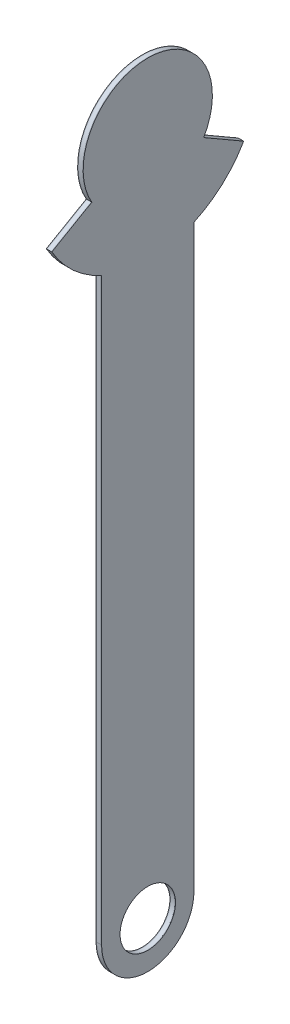
ISO-10303-21;
HEADER;
FILE_DESCRIPTION(('STEP AP214'),'2;1');
FILE_NAME('part.step','',(''),(''),'','','');
FILE_SCHEMA(('AUTOMOTIVE_DESIGN { 1 0 10303 214 1 1 1 1 }'));
ENDSEC;
DATA;
#1=APPLICATION_CONTEXT('core data for automotive mechanical design processes');
#2=APPLICATION_PROTOCOL_DEFINITION('international standard','automotive_design',2000,#1);
#3=PRODUCT_CONTEXT('',#1,'mechanical');
#4=PRODUCT('Part','Part','',(#3));
#5=PRODUCT_RELATED_PRODUCT_CATEGORY('part','',(#4));
#6=PRODUCT_DEFINITION_FORMATION('','',#4);
#7=PRODUCT_DEFINITION_CONTEXT('part definition',#1,'design');
#8=PRODUCT_DEFINITION('design','',#6,#7);
#9=PRODUCT_DEFINITION_SHAPE('','',#8);
#10=(LENGTH_UNIT() NAMED_UNIT(*) SI_UNIT(.MILLI.,.METRE.));
#11=(NAMED_UNIT(*) PLANE_ANGLE_UNIT() SI_UNIT($,.RADIAN.));
#12=(NAMED_UNIT(*) SI_UNIT($,.STERADIAN.) SOLID_ANGLE_UNIT());
#13=UNCERTAINTY_MEASURE_WITH_UNIT(LENGTH_MEASURE(1.E-05),#10,'distance_accuracy_value','');
#14=(GEOMETRIC_REPRESENTATION_CONTEXT(3) GLOBAL_UNCERTAINTY_ASSIGNED_CONTEXT((#13)) GLOBAL_UNIT_ASSIGNED_CONTEXT((#10,
#11,#12)) REPRESENTATION_CONTEXT('',''));
#15=CARTESIAN_POINT('',(0.,0.,0.));
#16=DIRECTION('',(0.,0.,1.));
#17=DIRECTION('',(1.,0.,0.));
#18=AXIS2_PLACEMENT_3D('',#15,#16,#17);
#19=CARTESIAN_POINT('',(-2.75,196.8,0.));
#20=DIRECTION('',(1.,0.,0.));
#21=DIRECTION('',(0.,0.,-1.));
#22=AXIS2_PLACEMENT_3D('',#19,#20,#21);
#23=CYLINDRICAL_SURFACE('',#22,60.);
#24=CARTESIAN_POINT('',(-2.5,196.8,0.));
#25=DIRECTION('',(-1.,0.,0.));
#26=DIRECTION('',(0.,0.,1.));
#27=AXIS2_PLACEMENT_3D('',#24,#25,#26);
#28=CIRCLE('',#27,60.);
#29=CARTESIAN_POINT('',(-2.5,142.256439426821,25.));
#30=VERTEX_POINT('',#29);
#31=CARTESIAN_POINT('',(-2.5,166.8,51.9615242270665));
#32=VERTEX_POINT('',#31);
#33=EDGE_CURVE('E162',#30,#32,#28,.T.);
#34=ORIENTED_EDGE('',*,*,#33,.T.);
#35=DIRECTION('',(1.,0.,0.));
#36=VECTOR('',#35,1.);
#37=CARTESIAN_POINT('',(-2.75,166.8,51.9615242270665));
#38=LINE('',#37,#36);
#39=CARTESIAN_POINT('',(-2.75,166.8,51.9615242270665));
#40=VERTEX_POINT('',#39);
#41=EDGE_CURVE('E12',#40,#32,#38,.T.);
#42=ORIENTED_EDGE('',*,*,#41,.F.);
#43=CARTESIAN_POINT('',(-2.75,196.8,0.));
#44=DIRECTION('',(-1.,0.,0.));
#45=DIRECTION('',(0.,0.,1.));
#46=AXIS2_PLACEMENT_3D('',#43,#44,#45);
#47=CIRCLE('',#46,60.);
#48=CARTESIAN_POINT('',(-2.75,142.256439426821,25.));
#49=VERTEX_POINT('',#48);
#50=EDGE_CURVE('E208',#49,#40,#47,.T.);
#51=ORIENTED_EDGE('',*,*,#50,.F.);
#52=DIRECTION('',(1.,0.,0.));
#53=VECTOR('',#52,1.);
#54=CARTESIAN_POINT('',(-2.75,142.256439426821,25.));
#55=LINE('',#54,#53);
#56=EDGE_CURVE('E155',#49,#30,#55,.T.);
#57=ORIENTED_EDGE('',*,*,#56,.T.);
#58=EDGE_LOOP('',(#34,#42,#51,#57));
#59=FACE_BOUND('',#58,.T.);
#60=ADVANCED_FACE('F62',(#59),#23,.T.);
#61=CARTESIAN_POINT('',(-2.75,147.600000000001,85.2168997323883));
#62=DIRECTION('',(0.,-0.866025403784441,-0.499999999999995));
#63=DIRECTION('',(0.,0.499999999999995,-0.866025403784442));
#64=AXIS2_PLACEMENT_3D('',#61,#62,#63);
#65=PLANE('',#64);
#66=DIRECTION('',(0.,0.499999999999995,-0.866025403784442));
#67=VECTOR('',#66,1.);
#68=CARTESIAN_POINT('',(-2.5,147.600000000001,85.2168997323883));
#69=LINE('',#68,#67);
#70=CARTESIAN_POINT('',(-2.5,179.3,30.3108891324555));
#71=VERTEX_POINT('',#70);
#72=EDGE_CURVE('E165',#32,#71,#69,.T.);
#73=ORIENTED_EDGE('',*,*,#72,.T.);
#74=DIRECTION('',(1.,0.,0.));
#75=VECTOR('',#74,1.);
#76=CARTESIAN_POINT('',(-2.75,179.3,30.3108891324555));
#77=LINE('',#76,#75);
#78=CARTESIAN_POINT('',(-2.75,179.3,30.3108891324555));
#79=VERTEX_POINT('',#78);
#80=EDGE_CURVE('E71',#79,#71,#77,.T.);
#81=ORIENTED_EDGE('',*,*,#80,.F.);
#82=DIRECTION('',(0.,0.499999999999995,-0.866025403784442));
#83=VECTOR('',#82,1.);
#84=CARTESIAN_POINT('',(-2.75,147.600000000001,85.2168997323883));
#85=LINE('',#84,#83);
#86=EDGE_CURVE('E122',#40,#79,#85,.T.);
#87=ORIENTED_EDGE('',*,*,#86,.F.);
#88=ORIENTED_EDGE('',*,*,#41,.T.);
#89=EDGE_LOOP('',(#73,#81,#87,#88));
#90=FACE_BOUND('',#89,.T.);
#91=ADVANCED_FACE('F227',(#90),#65,.F.);
#92=CARTESIAN_POINT('',(-2.75,196.8,0.));
#93=DIRECTION('',(1.,0.,0.));
#94=DIRECTION('',(0.,0.,-1.));
#95=AXIS2_PLACEMENT_3D('',#92,#93,#94);
#96=CYLINDRICAL_SURFACE('',#95,35.);
#97=CARTESIAN_POINT('',(-2.5,196.8,0.));
#98=DIRECTION('',(-1.,0.,0.));
#99=DIRECTION('',(0.,0.,1.));
#100=AXIS2_PLACEMENT_3D('',#97,#98,#99);
#101=CIRCLE('',#100,35.);
#102=CARTESIAN_POINT('',(-2.5,179.3,-30.3108891324553));
#103=VERTEX_POINT('',#102);
#104=EDGE_CURVE('E167',#71,#103,#101,.T.);
#105=ORIENTED_EDGE('',*,*,#104,.T.);
#106=DIRECTION('',(1.,0.,0.));
#107=VECTOR('',#106,1.);
#108=CARTESIAN_POINT('',(-2.75,179.3,-30.3108891324553));
#109=LINE('',#108,#107);
#110=CARTESIAN_POINT('',(-2.75,179.3,-30.3108891324553));
#111=VERTEX_POINT('',#110);
#112=EDGE_CURVE('E183',#111,#103,#109,.T.);
#113=ORIENTED_EDGE('',*,*,#112,.F.);
#114=CARTESIAN_POINT('',(-2.75,196.8,0.));
#115=DIRECTION('',(-1.,0.,0.));
#116=DIRECTION('',(0.,0.,1.));
#117=AXIS2_PLACEMENT_3D('',#114,#115,#116);
#118=CIRCLE('',#117,35.);
#119=EDGE_CURVE('E191',#79,#111,#118,.T.);
#120=ORIENTED_EDGE('',*,*,#119,.F.);
#121=ORIENTED_EDGE('',*,*,#80,.T.);
#122=EDGE_LOOP('',(#105,#113,#120,#121));
#123=FACE_BOUND('',#122,.T.);
#124=ADVANCED_FACE('F189',(#123),#96,.T.);
#125=CARTESIAN_POINT('',(-2.75,147.6,-85.2168997323889));
#126=DIRECTION('',(0.,-0.866025403784438,0.500000000000001));
#127=DIRECTION('',(0.,-0.500000000000001,-0.866025403784438));
#128=AXIS2_PLACEMENT_3D('',#125,#126,#127);
#129=PLANE('',#128);
#130=DIRECTION('',(0.,-0.500000000000001,-0.866025403784438));
#131=VECTOR('',#130,1.);
#132=CARTESIAN_POINT('',(-2.5,147.6,-85.2168997323889));
#133=LINE('',#132,#131);
#134=CARTESIAN_POINT('',(-2.5,166.8,-51.9615242270663));
#135=VERTEX_POINT('',#134);
#136=EDGE_CURVE('E169',#103,#135,#133,.T.);
#137=ORIENTED_EDGE('',*,*,#136,.T.);
#138=DIRECTION('',(1.,0.,0.));
#139=VECTOR('',#138,1.);
#140=CARTESIAN_POINT('',(-2.75,166.8,-51.9615242270663));
#141=LINE('',#140,#139);
#142=CARTESIAN_POINT('',(-2.75,166.8,-51.9615242270663));
#143=VERTEX_POINT('',#142);
#144=EDGE_CURVE('E180',#143,#135,#141,.T.);
#145=ORIENTED_EDGE('',*,*,#144,.F.);
#146=DIRECTION('',(0.,-0.500000000000001,-0.866025403784438));
#147=VECTOR('',#146,1.);
#148=CARTESIAN_POINT('',(-2.75,147.6,-85.2168997323889));
#149=LINE('',#148,#147);
#150=EDGE_CURVE('E203',#111,#143,#149,.T.);
#151=ORIENTED_EDGE('',*,*,#150,.F.);
#152=ORIENTED_EDGE('',*,*,#112,.T.);
#153=EDGE_LOOP('',(#137,#145,#151,#152));
#154=FACE_BOUND('',#153,.T.);
#155=ADVANCED_FACE('F199',(#154),#129,.F.);
#156=CARTESIAN_POINT('',(-2.75,196.8,0.));
#157=DIRECTION('',(1.,0.,0.));
#158=DIRECTION('',(0.,0.,-1.));
#159=AXIS2_PLACEMENT_3D('',#156,#157,#158);
#160=CYLINDRICAL_SURFACE('',#159,60.);
#161=CARTESIAN_POINT('',(-2.5,196.8,0.));
#162=DIRECTION('',(-1.,0.,0.));
#163=DIRECTION('',(0.,0.,1.));
#164=AXIS2_PLACEMENT_3D('',#161,#162,#163);
#165=CIRCLE('',#164,60.);
#166=CARTESIAN_POINT('',(-2.5,142.256439426821,-25.));
#167=VERTEX_POINT('',#166);
#168=EDGE_CURVE('E171',#135,#167,#165,.T.);
#169=ORIENTED_EDGE('',*,*,#168,.T.);
#170=DIRECTION('',(1.,0.,0.));
#171=VECTOR('',#170,1.);
#172=CARTESIAN_POINT('',(-2.75,142.256439426821,-25.));
#173=LINE('',#172,#171);
#174=CARTESIAN_POINT('',(-2.75,142.256439426821,-25.));
#175=VERTEX_POINT('',#174);
#176=EDGE_CURVE('E150',#175,#167,#173,.T.);
#177=ORIENTED_EDGE('',*,*,#176,.F.);
#178=CARTESIAN_POINT('',(-2.75,196.8,0.));
#179=DIRECTION('',(-1.,0.,0.));
#180=DIRECTION('',(0.,0.,1.));
#181=AXIS2_PLACEMENT_3D('',#178,#179,#180);
#182=CIRCLE('',#181,60.);
#183=EDGE_CURVE('E141',#143,#175,#182,.T.);
#184=ORIENTED_EDGE('',*,*,#183,.F.);
#185=ORIENTED_EDGE('',*,*,#144,.T.);
#186=EDGE_LOOP('',(#169,#177,#184,#185));
#187=FACE_BOUND('',#186,.T.);
#188=ADVANCED_FACE('F202',(#187),#160,.T.);
#189=CARTESIAN_POINT('',(-2.75,0.,-25.));
#190=DIRECTION('',(0.,0.,1.));
#191=DIRECTION('',(1.,0.,0.));
#192=AXIS2_PLACEMENT_3D('',#189,#190,#191);
#193=PLANE('',#192);
#194=DIRECTION('',(0.,-1.,0.));
#195=VECTOR('',#194,1.);
#196=CARTESIAN_POINT('',(-2.5,0.,-25.));
#197=LINE('',#196,#195);
#198=CARTESIAN_POINT('',(-2.5,-171.8,-25.));
#199=VERTEX_POINT('',#198);
#200=EDGE_CURVE('E149',#167,#199,#197,.T.);
#201=ORIENTED_EDGE('',*,*,#200,.T.);
#202=DIRECTION('',(1.,0.,0.));
#203=VECTOR('',#202,1.);
#204=CARTESIAN_POINT('',(-2.75,-171.8,-25.));
#205=LINE('',#204,#203);
#206=CARTESIAN_POINT('',(-2.75,-171.8,-25.));
#207=VERTEX_POINT('',#206);
#208=EDGE_CURVE('E146',#207,#199,#205,.T.);
#209=ORIENTED_EDGE('',*,*,#208,.F.);
#210=DIRECTION('',(0.,-1.,0.));
#211=VECTOR('',#210,1.);
#212=CARTESIAN_POINT('',(-2.75,0.,-25.));
#213=LINE('',#212,#211);
#214=EDGE_CURVE('E135',#175,#207,#213,.T.);
#215=ORIENTED_EDGE('',*,*,#214,.F.);
#216=ORIENTED_EDGE('',*,*,#176,.T.);
#217=EDGE_LOOP('',(#201,#209,#215,#216));
#218=FACE_BOUND('',#217,.T.);
#219=ADVANCED_FACE('F147',(#218),#193,.F.);
#220=CARTESIAN_POINT('',(-2.75,-171.8,0.));
#221=DIRECTION('',(1.,0.,0.));
#222=DIRECTION('',(0.,0.,-1.));
#223=AXIS2_PLACEMENT_3D('',#220,#221,#222);
#224=CYLINDRICAL_SURFACE('',#223,25.);
#225=CARTESIAN_POINT('',(-2.5,-171.8,0.));
#226=DIRECTION('',(-1.,0.,0.));
#227=DIRECTION('',(0.,0.,1.));
#228=AXIS2_PLACEMENT_3D('',#225,#226,#227);
#229=CIRCLE('',#228,25.);
#230=CARTESIAN_POINT('',(-2.5,-171.8,25.));
#231=VERTEX_POINT('',#230);
#232=EDGE_CURVE('E108',#199,#231,#229,.T.);
#233=ORIENTED_EDGE('',*,*,#232,.T.);
#234=DIRECTION('',(1.,0.,0.));
#235=VECTOR('',#234,1.);
#236=CARTESIAN_POINT('',(-2.75,-171.8,25.));
#237=LINE('',#236,#235);
#238=CARTESIAN_POINT('',(-2.75,-171.8,25.));
#239=VERTEX_POINT('',#238);
#240=EDGE_CURVE('E151',#239,#231,#237,.T.);
#241=ORIENTED_EDGE('',*,*,#240,.F.);
#242=CARTESIAN_POINT('',(-2.75,-171.8,0.));
#243=DIRECTION('',(-1.,0.,0.));
#244=DIRECTION('',(0.,0.,1.));
#245=AXIS2_PLACEMENT_3D('',#242,#243,#244);
#246=CIRCLE('',#245,25.);
#247=EDGE_CURVE('E139',#207,#239,#246,.T.);
#248=ORIENTED_EDGE('',*,*,#247,.F.);
#249=ORIENTED_EDGE('',*,*,#208,.T.);
#250=EDGE_LOOP('',(#233,#241,#248,#249));
#251=FACE_BOUND('',#250,.T.);
#252=ADVANCED_FACE('F153',(#251),#224,.T.);
#253=CARTESIAN_POINT('',(-2.75,-171.8,0.));
#254=DIRECTION('',(1.,0.,0.));
#255=DIRECTION('',(0.,0.,-1.));
#256=AXIS2_PLACEMENT_3D('',#253,#254,#255);
#257=CYLINDRICAL_SURFACE('',#256,15.);
#258=CARTESIAN_POINT('',(-2.75,-171.8,0.));
#259=DIRECTION('',(-1.,0.,0.));
#260=DIRECTION('',(0.,0.,1.));
#261=AXIS2_PLACEMENT_3D('',#258,#259,#260);
#262=CIRCLE('',#261,15.);
#263=CARTESIAN_POINT('',(-2.75,-171.8,15.));
#264=VERTEX_POINT('',#263);
#265=EDGE_CURVE('E176',#264,#264,#262,.F.);
#266=ORIENTED_EDGE('',*,*,#265,.F.);
#267=EDGE_LOOP('',(#266));
#268=FACE_BOUND('',#267,.T.);
#269=CARTESIAN_POINT('',(-2.5,-171.8,0.));
#270=DIRECTION('',(-1.,0.,0.));
#271=DIRECTION('',(0.,0.,1.));
#272=AXIS2_PLACEMENT_3D('',#269,#270,#271);
#273=CIRCLE('',#272,15.);
#274=CARTESIAN_POINT('',(-2.5,-171.8,15.));
#275=VERTEX_POINT('',#274);
#276=EDGE_CURVE('E159',#275,#275,#273,.F.);
#277=ORIENTED_EDGE('',*,*,#276,.T.);
#278=EDGE_LOOP('',(#277));
#279=FACE_BOUND('',#278,.T.);
#280=ADVANCED_FACE('F64',(#268,#279),#257,.F.);
#281=CARTESIAN_POINT('',(-2.75,0.,25.));
#282=DIRECTION('',(0.,0.,-1.));
#283=DIRECTION('',(-1.,0.,0.));
#284=AXIS2_PLACEMENT_3D('',#281,#282,#283);
#285=PLANE('',#284);
#286=DIRECTION('',(0.,1.,0.));
#287=VECTOR('',#286,1.);
#288=CARTESIAN_POINT('',(-2.5,0.,25.));
#289=LINE('',#288,#287);
#290=EDGE_CURVE('E114',#231,#30,#289,.T.);
#291=ORIENTED_EDGE('',*,*,#290,.T.);
#292=ORIENTED_EDGE('',*,*,#56,.F.);
#293=DIRECTION('',(0.,1.,0.));
#294=VECTOR('',#293,1.);
#295=CARTESIAN_POINT('',(-2.75,0.,25.));
#296=LINE('',#295,#294);
#297=EDGE_CURVE('E79',#239,#49,#296,.T.);
#298=ORIENTED_EDGE('',*,*,#297,.F.);
#299=ORIENTED_EDGE('',*,*,#240,.T.);
#300=EDGE_LOOP('',(#291,#292,#298,#299));
#301=FACE_BOUND('',#300,.T.);
#302=ADVANCED_FACE('F216',(#301),#285,.F.);
#303=CARTESIAN_POINT('',(-2.75,0.,0.));
#304=DIRECTION('',(-1.,0.,0.));
#305=DIRECTION('',(0.,0.,1.));
#306=AXIS2_PLACEMENT_3D('',#303,#304,#305);
#307=PLANE('',#306);
#308=ORIENTED_EDGE('',*,*,#265,.T.);
#309=EDGE_LOOP('',(#308));
#310=FACE_BOUND('',#309,.T.);
#311=ORIENTED_EDGE('',*,*,#50,.T.);
#312=ORIENTED_EDGE('',*,*,#86,.T.);
#313=ORIENTED_EDGE('',*,*,#119,.T.);
#314=ORIENTED_EDGE('',*,*,#150,.T.);
#315=ORIENTED_EDGE('',*,*,#183,.T.);
#316=ORIENTED_EDGE('',*,*,#214,.T.);
#317=ORIENTED_EDGE('',*,*,#247,.T.);
#318=ORIENTED_EDGE('',*,*,#297,.T.);
#319=EDGE_LOOP('',(#311,#312,#313,#314,#315,#316,#317,#318));
#320=FACE_BOUND('',#319,.T.);
#321=ADVANCED_FACE('F137',(#310,#320),#307,.T.);
#322=CARTESIAN_POINT('',(-2.5,0.,0.));
#323=DIRECTION('',(-1.,0.,0.));
#324=DIRECTION('',(0.,0.,1.));
#325=AXIS2_PLACEMENT_3D('',#322,#323,#324);
#326=PLANE('',#325);
#327=ORIENTED_EDGE('',*,*,#276,.F.);
#328=EDGE_LOOP('',(#327));
#329=FACE_BOUND('',#328,.T.);
#330=ORIENTED_EDGE('',*,*,#33,.F.);
#331=ORIENTED_EDGE('',*,*,#290,.F.);
#332=ORIENTED_EDGE('',*,*,#232,.F.);
#333=ORIENTED_EDGE('',*,*,#200,.F.);
#334=ORIENTED_EDGE('',*,*,#168,.F.);
#335=ORIENTED_EDGE('',*,*,#136,.F.);
#336=ORIENTED_EDGE('',*,*,#104,.F.);
#337=ORIENTED_EDGE('',*,*,#72,.F.);
#338=EDGE_LOOP('',(#330,#331,#332,#333,#334,#335,#336,#337));
#339=FACE_BOUND('',#338,.T.);
#340=ADVANCED_FACE('F195',(#329,#339),#326,.F.);
#341=CLOSED_SHELL('',(#60,#91,#124,#155,#188,#219,#252,#280,#302,#321,#340));
#342=MANIFOLD_SOLID_BREP('B2',#341);
#343=CARTESIAN_POINT('',(-2.5,147.600000000001,85.2168997323882));
#344=DIRECTION('',(0.,-0.866025403784442,-0.499999999999995));
#345=DIRECTION('',(0.,0.499999999999995,-0.866025403784442));
#346=AXIS2_PLACEMENT_3D('',#343,#344,#345);
#347=PLANE('',#346);
#348=DIRECTION('',(0.,0.499999999999995,-0.866025403784442));
#349=VECTOR('',#348,1.);
#350=CARTESIAN_POINT('',(0.,147.600000000001,85.2168997323882));
#351=LINE('',#350,#349);
#352=CARTESIAN_POINT('',(0.,166.8,51.9615242270665));
#353=VERTEX_POINT('',#352);
#354=CARTESIAN_POINT('',(0.,179.3,30.3108891324555));
#355=VERTEX_POINT('',#354);
#356=EDGE_CURVE('E429',#353,#355,#351,.T.);
#357=ORIENTED_EDGE('',*,*,#356,.T.);
#358=DIRECTION('',(1.,0.,0.));
#359=VECTOR('',#358,1.);
#360=CARTESIAN_POINT('',(-2.5,179.3,30.3108891324555));
#361=LINE('',#360,#359);
#362=CARTESIAN_POINT('',(-2.5,179.3,30.3108891324555));
#363=VERTEX_POINT('',#362);
#364=EDGE_CURVE('E60',#363,#355,#361,.T.);
#365=ORIENTED_EDGE('',*,*,#364,.F.);
#366=DIRECTION('',(0.,0.499999999999995,-0.866025403784442));
#367=VECTOR('',#366,1.);
#368=CARTESIAN_POINT('',(-2.5,147.600000000001,85.2168997323882));
#369=LINE('',#368,#367);
#370=CARTESIAN_POINT('',(-2.5,166.8,51.9615242270665));
#371=VERTEX_POINT('',#370);
#372=EDGE_CURVE('E455',#371,#363,#369,.T.);
#373=ORIENTED_EDGE('',*,*,#372,.F.);
#374=DIRECTION('',(1.,0.,0.));
#375=VECTOR('',#374,1.);
#376=CARTESIAN_POINT('',(-2.5,166.8,51.9615242270665));
#377=LINE('',#376,#375);
#378=EDGE_CURVE('E428',#371,#353,#377,.T.);
#379=ORIENTED_EDGE('',*,*,#378,.T.);
#380=EDGE_LOOP('',(#357,#365,#373,#379));
#381=FACE_BOUND('',#380,.T.);
#382=ADVANCED_FACE('F323',(#381),#347,.F.);
#383=CARTESIAN_POINT('',(-2.5,196.8,0.));
#384=DIRECTION('',(1.,0.,0.));
#385=DIRECTION('',(0.,0.,-1.));
#386=AXIS2_PLACEMENT_3D('',#383,#384,#385);
#387=CYLINDRICAL_SURFACE('',#386,35.);
#388=CARTESIAN_POINT('',(0.,196.8,0.));
#389=DIRECTION('',(-1.,0.,0.));
#390=DIRECTION('',(0.,0.,1.));
#391=AXIS2_PLACEMENT_3D('',#388,#389,#390);
#392=CIRCLE('',#391,35.);
#393=CARTESIAN_POINT('',(0.,179.3,-30.3108891324553));
#394=VERTEX_POINT('',#393);
#395=EDGE_CURVE('E433',#355,#394,#392,.T.);
#396=ORIENTED_EDGE('',*,*,#395,.T.);
#397=DIRECTION('',(1.,0.,0.));
#398=VECTOR('',#397,1.);
#399=CARTESIAN_POINT('',(-2.5,179.3,-30.3108891324553));
#400=LINE('',#399,#398);
#401=CARTESIAN_POINT('',(-2.5,179.3,-30.3108891324553));
#402=VERTEX_POINT('',#401);
#403=EDGE_CURVE('E332',#402,#394,#400,.T.);
#404=ORIENTED_EDGE('',*,*,#403,.F.);
#405=CARTESIAN_POINT('',(-2.5,196.8,0.));
#406=DIRECTION('',(-1.,0.,0.));
#407=DIRECTION('',(0.,0.,1.));
#408=AXIS2_PLACEMENT_3D('',#405,#406,#407);
#409=CIRCLE('',#408,35.);
#410=EDGE_CURVE('E383',#363,#402,#409,.T.);
#411=ORIENTED_EDGE('',*,*,#410,.F.);
#412=ORIENTED_EDGE('',*,*,#364,.T.);
#413=EDGE_LOOP('',(#396,#404,#411,#412));
#414=FACE_BOUND('',#413,.T.);
#415=ADVANCED_FACE('F502',(#414),#387,.T.);
#416=CARTESIAN_POINT('',(-2.5,147.6,-85.2168997323889));
#417=DIRECTION('',(0.,-0.866025403784438,0.500000000000001));
#418=DIRECTION('',(0.,-0.500000000000001,-0.866025403784438));
#419=AXIS2_PLACEMENT_3D('',#416,#417,#418);
#420=PLANE('',#419);
#421=DIRECTION('',(0.,-0.500000000000001,-0.866025403784438));
#422=VECTOR('',#421,1.);
#423=CARTESIAN_POINT('',(0.,147.6,-85.2168997323889));
#424=LINE('',#423,#422);
#425=CARTESIAN_POINT('',(0.,166.8,-51.9615242270663));
#426=VERTEX_POINT('',#425);
#427=EDGE_CURVE('E436',#394,#426,#424,.T.);
#428=ORIENTED_EDGE('',*,*,#427,.T.);
#429=DIRECTION('',(1.,0.,0.));
#430=VECTOR('',#429,1.);
#431=CARTESIAN_POINT('',(-2.5,166.8,-51.9615242270663));
#432=LINE('',#431,#430);
#433=CARTESIAN_POINT('',(-2.5,166.8,-51.9615242270663));
#434=VERTEX_POINT('',#433);
#435=EDGE_CURVE('E466',#434,#426,#432,.T.);
#436=ORIENTED_EDGE('',*,*,#435,.F.);
#437=DIRECTION('',(0.,-0.500000000000001,-0.866025403784438));
#438=VECTOR('',#437,1.);
#439=CARTESIAN_POINT('',(-2.5,147.6,-85.2168997323889));
#440=LINE('',#439,#438);
#441=EDGE_CURVE('E476',#402,#434,#440,.T.);
#442=ORIENTED_EDGE('',*,*,#441,.F.);
#443=ORIENTED_EDGE('',*,*,#403,.T.);
#444=EDGE_LOOP('',(#428,#436,#442,#443));
#445=FACE_BOUND('',#444,.T.);
#446=ADVANCED_FACE('F474',(#445),#420,.F.);
#447=CARTESIAN_POINT('',(-2.5,196.8,0.));
#448=DIRECTION('',(1.,0.,0.));
#449=DIRECTION('',(0.,0.,-1.));
#450=AXIS2_PLACEMENT_3D('',#447,#448,#449);
#451=CYLINDRICAL_SURFACE('',#450,60.);
#452=CARTESIAN_POINT('',(0.,196.8,0.));
#453=DIRECTION('',(-1.,0.,0.));
#454=DIRECTION('',(0.,0.,1.));
#455=AXIS2_PLACEMENT_3D('',#452,#453,#454);
#456=CIRCLE('',#455,60.);
#457=CARTESIAN_POINT('',(0.,142.256439426821,-25.));
#458=VERTEX_POINT('',#457);
#459=EDGE_CURVE('E439',#426,#458,#456,.T.);
#460=ORIENTED_EDGE('',*,*,#459,.T.);
#461=DIRECTION('',(1.,0.,0.));
#462=VECTOR('',#461,1.);
#463=CARTESIAN_POINT('',(-2.5,142.256439426821,-25.));
#464=LINE('',#463,#462);
#465=CARTESIAN_POINT('',(-2.5,142.256439426821,-25.));
#466=VERTEX_POINT('',#465);
#467=EDGE_CURVE('E462',#466,#458,#464,.T.);
#468=ORIENTED_EDGE('',*,*,#467,.F.);
#469=CARTESIAN_POINT('',(-2.5,196.8,0.));
#470=DIRECTION('',(-1.,0.,0.));
#471=DIRECTION('',(0.,0.,1.));
#472=AXIS2_PLACEMENT_3D('',#469,#470,#471);
#473=CIRCLE('',#472,60.);
#474=EDGE_CURVE('E490',#434,#466,#473,.T.);
#475=ORIENTED_EDGE('',*,*,#474,.F.);
#476=ORIENTED_EDGE('',*,*,#435,.T.);
#477=EDGE_LOOP('',(#460,#468,#475,#476));
#478=FACE_BOUND('',#477,.T.);
#479=ADVANCED_FACE('F485',(#478),#451,.T.);
#480=CARTESIAN_POINT('',(-2.5,0.,-25.));
#481=DIRECTION('',(0.,0.,1.));
#482=DIRECTION('',(1.,0.,0.));
#483=AXIS2_PLACEMENT_3D('',#480,#481,#482);
#484=PLANE('',#483);
#485=DIRECTION('',(0.,-1.,0.));
#486=VECTOR('',#485,1.);
#487=CARTESIAN_POINT('',(0.,0.,-25.));
#488=LINE('',#487,#486);
#489=CARTESIAN_POINT('',(0.,-171.8,-25.));
#490=VERTEX_POINT('',#489);
#491=EDGE_CURVE('E442',#458,#490,#488,.T.);
#492=ORIENTED_EDGE('',*,*,#491,.T.);
#493=DIRECTION('',(1.,0.,0.));
#494=VECTOR('',#493,1.);
#495=CARTESIAN_POINT('',(-2.5,-171.8,-25.));
#496=LINE('',#495,#494);
#497=CARTESIAN_POINT('',(-2.5,-171.8,-25.));
#498=VERTEX_POINT('',#497);
#499=EDGE_CURVE('E414',#498,#490,#496,.T.);
#500=ORIENTED_EDGE('',*,*,#499,.F.);
#501=DIRECTION('',(0.,-1.,0.));
#502=VECTOR('',#501,1.);
#503=CARTESIAN_POINT('',(-2.5,0.,-25.));
#504=LINE('',#503,#502);
#505=EDGE_CURVE('E403',#466,#498,#504,.T.);
#506=ORIENTED_EDGE('',*,*,#505,.F.);
#507=ORIENTED_EDGE('',*,*,#467,.T.);
#508=EDGE_LOOP('',(#492,#500,#506,#507));
#509=FACE_BOUND('',#508,.T.);
#510=ADVANCED_FACE('F488',(#509),#484,.F.);
#511=CARTESIAN_POINT('',(-2.5,-171.8,0.));
#512=DIRECTION('',(1.,0.,0.));
#513=DIRECTION('',(0.,0.,-1.));
#514=AXIS2_PLACEMENT_3D('',#511,#512,#513);
#515=CYLINDRICAL_SURFACE('',#514,25.);
#516=CARTESIAN_POINT('',(0.,-171.8,0.));
#517=DIRECTION('',(-1.,0.,0.));
#518=DIRECTION('',(0.,0.,1.));
#519=AXIS2_PLACEMENT_3D('',#516,#517,#518);
#520=CIRCLE('',#519,25.);
#521=CARTESIAN_POINT('',(0.,-171.8,25.));
#522=VERTEX_POINT('',#521);
#523=EDGE_CURVE('E412',#490,#522,#520,.T.);
#524=ORIENTED_EDGE('',*,*,#523,.T.);
#525=DIRECTION('',(1.,0.,0.));
#526=VECTOR('',#525,1.);
#527=CARTESIAN_POINT('',(-2.5,-171.8,25.));
#528=LINE('',#527,#526);
#529=CARTESIAN_POINT('',(-2.5,-171.8,25.));
#530=VERTEX_POINT('',#529);
#531=EDGE_CURVE('E409',#530,#522,#528,.T.);
#532=ORIENTED_EDGE('',*,*,#531,.F.);
#533=CARTESIAN_POINT('',(-2.5,-171.8,0.));
#534=DIRECTION('',(-1.,0.,0.));
#535=DIRECTION('',(0.,0.,1.));
#536=AXIS2_PLACEMENT_3D('',#533,#534,#535);
#537=CIRCLE('',#536,25.);
#538=EDGE_CURVE('E396',#498,#530,#537,.T.);
#539=ORIENTED_EDGE('',*,*,#538,.F.);
#540=ORIENTED_EDGE('',*,*,#499,.T.);
#541=EDGE_LOOP('',(#524,#532,#539,#540));
#542=FACE_BOUND('',#541,.T.);
#543=ADVANCED_FACE('F410',(#542),#515,.T.);
#544=CARTESIAN_POINT('',(-2.5,0.,25.));
#545=DIRECTION('',(0.,0.,-1.));
#546=DIRECTION('',(-1.,0.,0.));
#547=AXIS2_PLACEMENT_3D('',#544,#545,#546);
#548=PLANE('',#547);
#549=DIRECTION('',(0.,1.,0.));
#550=VECTOR('',#549,1.);
#551=CARTESIAN_POINT('',(0.,0.,25.));
#552=LINE('',#551,#550);
#553=CARTESIAN_POINT('',(0.,142.256439426821,25.));
#554=VERTEX_POINT('',#553);
#555=EDGE_CURVE('E369',#522,#554,#552,.T.);
#556=ORIENTED_EDGE('',*,*,#555,.T.);
#557=DIRECTION('',(1.,0.,0.));
#558=VECTOR('',#557,1.);
#559=CARTESIAN_POINT('',(-2.5,142.256439426821,25.));
#560=LINE('',#559,#558);
#561=CARTESIAN_POINT('',(-2.5,142.256439426821,25.));
#562=VERTEX_POINT('',#561);
#563=EDGE_CURVE('E415',#562,#554,#560,.T.);
#564=ORIENTED_EDGE('',*,*,#563,.F.);
#565=DIRECTION('',(0.,1.,0.));
#566=VECTOR('',#565,1.);
#567=CARTESIAN_POINT('',(-2.5,0.,25.));
#568=LINE('',#567,#566);
#569=EDGE_CURVE('E401',#530,#562,#568,.T.);
#570=ORIENTED_EDGE('',*,*,#569,.F.);
#571=ORIENTED_EDGE('',*,*,#531,.T.);
#572=EDGE_LOOP('',(#556,#564,#570,#571));
#573=FACE_BOUND('',#572,.T.);
#574=ADVANCED_FACE('F417',(#573),#548,.F.);
#575=CARTESIAN_POINT('',(-2.5,196.8,0.));
#576=DIRECTION('',(1.,0.,0.));
#577=DIRECTION('',(0.,0.,-1.));
#578=AXIS2_PLACEMENT_3D('',#575,#576,#577);
#579=CYLINDRICAL_SURFACE('',#578,60.);
#580=CARTESIAN_POINT('',(0.,196.8,0.));
#581=DIRECTION('',(-1.,0.,0.));
#582=DIRECTION('',(0.,0.,1.));
#583=AXIS2_PLACEMENT_3D('',#580,#581,#582);
#584=CIRCLE('',#583,60.);
#585=EDGE_CURVE('E375',#554,#353,#584,.T.);
#586=ORIENTED_EDGE('',*,*,#585,.T.);
#587=ORIENTED_EDGE('',*,*,#378,.F.);
#588=CARTESIAN_POINT('',(-2.5,196.8,0.));
#589=DIRECTION('',(-1.,0.,0.));
#590=DIRECTION('',(0.,0.,1.));
#591=AXIS2_PLACEMENT_3D('',#588,#589,#590);
#592=CIRCLE('',#591,60.);
#593=EDGE_CURVE('E340',#562,#371,#592,.T.);
#594=ORIENTED_EDGE('',*,*,#593,.F.);
#595=ORIENTED_EDGE('',*,*,#563,.T.);
#596=EDGE_LOOP('',(#586,#587,#594,#595));
#597=FACE_BOUND('',#596,.T.);
#598=ADVANCED_FACE('F518',(#597),#579,.T.);
#599=CARTESIAN_POINT('',(-2.5,-171.8,0.));
#600=DIRECTION('',(1.,0.,0.));
#601=DIRECTION('',(0.,0.,-1.));
#602=AXIS2_PLACEMENT_3D('',#599,#600,#601);
#603=CYLINDRICAL_SURFACE('',#602,15.);
#604=CARTESIAN_POINT('',(-2.5,-171.8,0.));
#605=DIRECTION('',(-1.,0.,0.));
#606=DIRECTION('',(0.,0.,1.));
#607=AXIS2_PLACEMENT_3D('',#604,#605,#606);
#608=CIRCLE('',#607,15.);
#609=CARTESIAN_POINT('',(-2.5,-171.8,15.));
#610=VERTEX_POINT('',#609);
#611=EDGE_CURVE('E421',#610,#610,#608,.F.);
#612=ORIENTED_EDGE('',*,*,#611,.F.);
#613=EDGE_LOOP('',(#612));
#614=FACE_BOUND('',#613,.T.);
#615=CARTESIAN_POINT('',(0.,-171.8,0.));
#616=DIRECTION('',(-1.,0.,0.));
#617=DIRECTION('',(0.,0.,1.));
#618=AXIS2_PLACEMENT_3D('',#615,#616,#617);
#619=CIRCLE('',#618,15.);
#620=CARTESIAN_POINT('',(0.,-171.8,15.));
#621=VERTEX_POINT('',#620);
#622=EDGE_CURVE('E451',#621,#621,#619,.F.);
#623=ORIENTED_EDGE('',*,*,#622,.T.);
#624=EDGE_LOOP('',(#623));
#625=FACE_BOUND('',#624,.T.);
#626=ADVANCED_FACE('F521',(#614,#625),#603,.F.);
#627=CARTESIAN_POINT('',(-2.5,0.,0.));
#628=DIRECTION('',(-1.,0.,0.));
#629=DIRECTION('',(0.,0.,1.));
#630=AXIS2_PLACEMENT_3D('',#627,#628,#629);
#631=PLANE('',#630);
#632=ORIENTED_EDGE('',*,*,#372,.T.);
#633=ORIENTED_EDGE('',*,*,#410,.T.);
#634=ORIENTED_EDGE('',*,*,#441,.T.);
#635=ORIENTED_EDGE('',*,*,#474,.T.);
#636=ORIENTED_EDGE('',*,*,#505,.T.);
#637=ORIENTED_EDGE('',*,*,#538,.T.);
#638=ORIENTED_EDGE('',*,*,#569,.T.);
#639=ORIENTED_EDGE('',*,*,#593,.T.);
#640=EDGE_LOOP('',(#632,#633,#634,#635,#636,#637,#638,#639));
#641=FACE_BOUND('',#640,.T.);
#642=ORIENTED_EDGE('',*,*,#611,.T.);
#643=EDGE_LOOP('',(#642));
#644=FACE_BOUND('',#643,.T.);
#645=ADVANCED_FACE('F398',(#641,#644),#631,.T.);
#646=CARTESIAN_POINT('',(0.,0.,0.));
#647=DIRECTION('',(-1.,0.,0.));
#648=DIRECTION('',(0.,0.,1.));
#649=AXIS2_PLACEMENT_3D('',#646,#647,#648);
#650=PLANE('',#649);
#651=ORIENTED_EDGE('',*,*,#356,.F.);
#652=ORIENTED_EDGE('',*,*,#585,.F.);
#653=ORIENTED_EDGE('',*,*,#555,.F.);
#654=ORIENTED_EDGE('',*,*,#523,.F.);
#655=ORIENTED_EDGE('',*,*,#491,.F.);
#656=ORIENTED_EDGE('',*,*,#459,.F.);
#657=ORIENTED_EDGE('',*,*,#427,.F.);
#658=ORIENTED_EDGE('',*,*,#395,.F.);
#659=EDGE_LOOP('',(#651,#652,#653,#654,#655,#656,#657,#658));
#660=FACE_BOUND('',#659,.T.);
#661=ORIENTED_EDGE('',*,*,#622,.F.);
#662=EDGE_LOOP('',(#661));
#663=FACE_BOUND('',#662,.T.);
#664=ADVANCED_FACE('F480',(#660,#663),#650,.F.);
#665=CLOSED_SHELL('',(#382,#415,#446,#479,#510,#543,#574,#598,#626,#645,#664));
#666=MANIFOLD_SOLID_BREP('B6',#665);
#667=CARTESIAN_POINT('',(0.25,196.8,0.));
#668=DIRECTION('',(-1.,0.,0.));
#669=DIRECTION('',(0.,0.,1.));
#670=AXIS2_PLACEMENT_3D('',#667,#668,#669);
#671=CYLINDRICAL_SURFACE('',#670,35.);
#672=CARTESIAN_POINT('',(0.,196.8,0.));
#673=DIRECTION('',(1.,0.,0.));
#674=DIRECTION('',(0.,0.,-1.));
#675=AXIS2_PLACEMENT_3D('',#672,#673,#674);
#676=CIRCLE('',#675,35.);
#677=CARTESIAN_POINT('',(0.,179.3,-30.3108891324553));
#678=VERTEX_POINT('',#677);
#679=CARTESIAN_POINT('',(0.,179.3,30.3108891324555));
#680=VERTEX_POINT('',#679);
#681=EDGE_CURVE('E703',#678,#680,#676,.T.);
#682=ORIENTED_EDGE('',*,*,#681,.T.);
#683=DIRECTION('',(-1.,0.,0.));
#684=VECTOR('',#683,1.);
#685=CARTESIAN_POINT('',(0.25,179.3,30.3108891324555));
#686=LINE('',#685,#684);
#687=CARTESIAN_POINT('',(0.25,179.3,30.3108891324555));
#688=VERTEX_POINT('',#687);
#689=EDGE_CURVE('E321',#688,#680,#686,.T.);
#690=ORIENTED_EDGE('',*,*,#689,.F.);
#691=CARTESIAN_POINT('',(0.25,196.8,0.));
#692=DIRECTION('',(1.,0.,0.));
#693=DIRECTION('',(0.,0.,-1.));
#694=AXIS2_PLACEMENT_3D('',#691,#692,#693);
#695=CIRCLE('',#694,35.);
#696=CARTESIAN_POINT('',(0.25,179.3,-30.3108891324553));
#697=VERTEX_POINT('',#696);
#698=EDGE_CURVE('E864',#697,#688,#695,.T.);
#699=ORIENTED_EDGE('',*,*,#698,.F.);
#700=DIRECTION('',(-1.,0.,0.));
#701=VECTOR('',#700,1.);
#702=CARTESIAN_POINT('',(0.25,179.3,-30.3108891324553));
#703=LINE('',#702,#701);
#704=EDGE_CURVE('E618',#697,#678,#703,.T.);
#705=ORIENTED_EDGE('',*,*,#704,.T.);
#706=EDGE_LOOP('',(#682,#690,#699,#705));
#707=FACE_BOUND('',#706,.T.);
#708=ADVANCED_FACE('F601',(#707),#671,.T.);
#709=CARTESIAN_POINT('',(0.25,147.600000000001,85.2168997323882));
#710=DIRECTION('',(0.,-0.866025403784441,-0.499999999999995));
#711=DIRECTION('',(0.,0.499999999999995,-0.866025403784442));
#712=AXIS2_PLACEMENT_3D('',#709,#710,#711);
#713=PLANE('',#712);
#714=DIRECTION('',(0.,-0.499999999999995,0.866025403784442));
#715=VECTOR('',#714,1.);
#716=CARTESIAN_POINT('',(0.,147.600000000001,85.2168997323882));
#717=LINE('',#716,#715);
#718=CARTESIAN_POINT('',(0.,166.8,51.9615242270666));
#719=VERTEX_POINT('',#718);
#720=EDGE_CURVE('E705',#680,#719,#717,.T.);
#721=ORIENTED_EDGE('',*,*,#720,.T.);
#722=DIRECTION('',(-1.,0.,0.));
#723=VECTOR('',#722,1.);
#724=CARTESIAN_POINT('',(0.25,166.8,51.9615242270666));
#725=LINE('',#724,#723);
#726=CARTESIAN_POINT('',(0.25,166.8,51.9615242270666));
#727=VERTEX_POINT('',#726);
#728=EDGE_CURVE('E610',#727,#719,#725,.T.);
#729=ORIENTED_EDGE('',*,*,#728,.F.);
#730=DIRECTION('',(0.,-0.499999999999995,0.866025403784442));
#731=VECTOR('',#730,1.);
#732=CARTESIAN_POINT('',(0.25,147.600000000001,85.2168997323882));
#733=LINE('',#732,#731);
#734=EDGE_CURVE('E657',#688,#727,#733,.T.);
#735=ORIENTED_EDGE('',*,*,#734,.F.);
#736=ORIENTED_EDGE('',*,*,#689,.T.);
#737=EDGE_LOOP('',(#721,#729,#735,#736));
#738=FACE_BOUND('',#737,.T.);
#739=ADVANCED_FACE('F759',(#738),#713,.F.);
#740=CARTESIAN_POINT('',(0.25,196.8,0.));
#741=DIRECTION('',(-1.,0.,0.));
#742=DIRECTION('',(0.,0.,1.));
#743=AXIS2_PLACEMENT_3D('',#740,#741,#742);
#744=CYLINDRICAL_SURFACE('',#743,60.);
#745=CARTESIAN_POINT('',(0.,196.8,0.));
#746=DIRECTION('',(1.,0.,0.));
#747=DIRECTION('',(0.,0.,-1.));
#748=AXIS2_PLACEMENT_3D('',#745,#746,#747);
#749=CIRCLE('',#748,60.);
#750=CARTESIAN_POINT('',(0.,142.256439426821,25.));
#751=VERTEX_POINT('',#750);
#752=EDGE_CURVE('E707',#719,#751,#749,.T.);
#753=ORIENTED_EDGE('',*,*,#752,.T.);
#754=DIRECTION('',(-1.,0.,0.));
#755=VECTOR('',#754,1.);
#756=CARTESIAN_POINT('',(0.25,142.256439426821,25.));
#757=LINE('',#756,#755);
#758=CARTESIAN_POINT('',(0.25,142.256439426821,25.));
#759=VERTEX_POINT('',#758);
#760=EDGE_CURVE('E727',#759,#751,#757,.T.);
#761=ORIENTED_EDGE('',*,*,#760,.F.);
#762=CARTESIAN_POINT('',(0.25,196.8,0.));
#763=DIRECTION('',(1.,0.,0.));
#764=DIRECTION('',(0.,0.,-1.));
#765=AXIS2_PLACEMENT_3D('',#762,#763,#764);
#766=CIRCLE('',#765,60.);
#767=EDGE_CURVE('E735',#727,#759,#766,.T.);
#768=ORIENTED_EDGE('',*,*,#767,.F.);
#769=ORIENTED_EDGE('',*,*,#728,.T.);
#770=EDGE_LOOP('',(#753,#761,#768,#769));
#771=FACE_BOUND('',#770,.T.);
#772=ADVANCED_FACE('F733',(#771),#744,.T.);
#773=CARTESIAN_POINT('',(0.25,0.,25.));
#774=DIRECTION('',(0.,0.,-1.));
#775=DIRECTION('',(-1.,0.,0.));
#776=AXIS2_PLACEMENT_3D('',#773,#774,#775);
#777=PLANE('',#776);
#778=DIRECTION('',(0.,-1.,0.));
#779=VECTOR('',#778,1.);
#780=CARTESIAN_POINT('',(0.,0.,25.));
#781=LINE('',#780,#779);
#782=CARTESIAN_POINT('',(0.,-171.8,25.));
#783=VERTEX_POINT('',#782);
#784=EDGE_CURVE('E709',#751,#783,#781,.T.);
#785=ORIENTED_EDGE('',*,*,#784,.T.);
#786=DIRECTION('',(-1.,0.,0.));
#787=VECTOR('',#786,1.);
#788=CARTESIAN_POINT('',(0.25,-171.8,25.));
#789=LINE('',#788,#787);
#790=CARTESIAN_POINT('',(0.25,-171.8,25.));
#791=VERTEX_POINT('',#790);
#792=EDGE_CURVE('E724',#791,#783,#789,.T.);
#793=ORIENTED_EDGE('',*,*,#792,.F.);
#794=DIRECTION('',(0.,-1.,0.));
#795=VECTOR('',#794,1.);
#796=CARTESIAN_POINT('',(0.25,0.,25.));
#797=LINE('',#796,#795);
#798=EDGE_CURVE('E695',#759,#791,#797,.T.);
#799=ORIENTED_EDGE('',*,*,#798,.F.);
#800=ORIENTED_EDGE('',*,*,#760,.T.);
#801=EDGE_LOOP('',(#785,#793,#799,#800));
#802=FACE_BOUND('',#801,.T.);
#803=ADVANCED_FACE('F742',(#802),#777,.F.);
#804=CARTESIAN_POINT('',(0.25,-171.8,0.));
#805=DIRECTION('',(-1.,0.,0.));
#806=DIRECTION('',(0.,0.,1.));
#807=AXIS2_PLACEMENT_3D('',#804,#805,#806);
#808=CYLINDRICAL_SURFACE('',#807,25.);
#809=CARTESIAN_POINT('',(0.,-171.8,0.));
#810=DIRECTION('',(1.,0.,0.));
#811=DIRECTION('',(0.,0.,-1.));
#812=AXIS2_PLACEMENT_3D('',#809,#810,#811);
#813=CIRCLE('',#812,25.);
#814=CARTESIAN_POINT('',(0.,-171.8,-25.));
#815=VERTEX_POINT('',#814);
#816=EDGE_CURVE('E711',#783,#815,#813,.T.);
#817=ORIENTED_EDGE('',*,*,#816,.T.);
#818=DIRECTION('',(-1.,0.,0.));
#819=VECTOR('',#818,1.);
#820=CARTESIAN_POINT('',(0.25,-171.8,-25.));
#821=LINE('',#820,#819);
#822=CARTESIAN_POINT('',(0.25,-171.8,-25.));
#823=VERTEX_POINT('',#822);
#824=EDGE_CURVE('E682',#823,#815,#821,.T.);
#825=ORIENTED_EDGE('',*,*,#824,.F.);
#826=CARTESIAN_POINT('',(0.25,-171.8,0.));
#827=DIRECTION('',(1.,0.,0.));
#828=DIRECTION('',(0.,0.,-1.));
#829=AXIS2_PLACEMENT_3D('',#826,#827,#828);
#830=CIRCLE('',#829,25.);
#831=EDGE_CURVE('E692',#791,#823,#830,.T.);
#832=ORIENTED_EDGE('',*,*,#831,.F.);
#833=ORIENTED_EDGE('',*,*,#792,.T.);
#834=EDGE_LOOP('',(#817,#825,#832,#833));
#835=FACE_BOUND('',#834,.T.);
#836=ADVANCED_FACE('F745',(#835),#808,.T.);
#837=CARTESIAN_POINT('',(0.25,0.,-25.));
#838=DIRECTION('',(0.,0.,-1.));
#839=DIRECTION('',(-1.,0.,0.));
#840=AXIS2_PLACEMENT_3D('',#837,#838,#839);
#841=PLANE('',#840);
#842=DIRECTION('',(0.,-1.,0.));
#843=VECTOR('',#842,1.);
#844=CARTESIAN_POINT('',(0.,0.,-25.));
#845=LINE('',#844,#843);
#846=CARTESIAN_POINT('',(0.,142.256439426821,-25.));
#847=VERTEX_POINT('',#846);
#848=EDGE_CURVE('E679',#847,#815,#845,.T.);
#849=ORIENTED_EDGE('',*,*,#848,.F.);
#850=DIRECTION('',(-1.,0.,0.));
#851=VECTOR('',#850,1.);
#852=CARTESIAN_POINT('',(0.25,142.256439426821,-25.));
#853=LINE('',#852,#851);
#854=CARTESIAN_POINT('',(0.25,142.256439426821,-25.));
#855=VERTEX_POINT('',#854);
#856=EDGE_CURVE('E673',#855,#847,#853,.T.);
#857=ORIENTED_EDGE('',*,*,#856,.F.);
#858=DIRECTION('',(0.,-1.,0.));
#859=VECTOR('',#858,1.);
#860=CARTESIAN_POINT('',(0.25,0.,-25.));
#861=LINE('',#860,#859);
#862=EDGE_CURVE('E677',#855,#823,#861,.T.);
#863=ORIENTED_EDGE('',*,*,#862,.T.);
#864=ORIENTED_EDGE('',*,*,#824,.T.);
#865=EDGE_LOOP('',(#849,#857,#863,#864));
#866=FACE_BOUND('',#865,.T.);
#867=ADVANCED_FACE('F675',(#866),#841,.T.);
#868=CARTESIAN_POINT('',(0.25,196.8,0.));
#869=DIRECTION('',(-1.,0.,0.));
#870=DIRECTION('',(0.,0.,1.));
#871=AXIS2_PLACEMENT_3D('',#868,#869,#870);
#872=CYLINDRICAL_SURFACE('',#871,60.);
#873=CARTESIAN_POINT('',(0.,196.8,0.));
#874=DIRECTION('',(1.,0.,0.));
#875=DIRECTION('',(0.,0.,-1.));
#876=AXIS2_PLACEMENT_3D('',#873,#874,#875);
#877=CIRCLE('',#876,60.);
#878=CARTESIAN_POINT('',(0.,166.8,-51.9615242270662));
#879=VERTEX_POINT('',#878);
#880=EDGE_CURVE('E715',#847,#879,#877,.T.);
#881=ORIENTED_EDGE('',*,*,#880,.T.);
#882=DIRECTION('',(-1.,0.,0.));
#883=VECTOR('',#882,1.);
#884=CARTESIAN_POINT('',(0.25,166.8,-51.9615242270662));
#885=LINE('',#884,#883);
#886=CARTESIAN_POINT('',(0.25,166.8,-51.9615242270662));
#887=VERTEX_POINT('',#886);
#888=EDGE_CURVE('E645',#887,#879,#885,.T.);
#889=ORIENTED_EDGE('',*,*,#888,.F.);
#890=CARTESIAN_POINT('',(0.25,196.8,0.));
#891=DIRECTION('',(1.,0.,0.));
#892=DIRECTION('',(0.,0.,-1.));
#893=AXIS2_PLACEMENT_3D('',#890,#891,#892);
#894=CIRCLE('',#893,60.);
#895=EDGE_CURVE('E684',#855,#887,#894,.T.);
#896=ORIENTED_EDGE('',*,*,#895,.F.);
#897=ORIENTED_EDGE('',*,*,#856,.T.);
#898=EDGE_LOOP('',(#881,#889,#896,#897));
#899=FACE_BOUND('',#898,.T.);
#900=ADVANCED_FACE('F685',(#899),#872,.T.);
#901=CARTESIAN_POINT('',(0.25,-171.8,0.));
#902=DIRECTION('',(-1.,0.,0.));
#903=DIRECTION('',(0.,0.,1.));
#904=AXIS2_PLACEMENT_3D('',#901,#902,#903);
#905=CYLINDRICAL_SURFACE('',#904,15.);
#906=CARTESIAN_POINT('',(0.25,-171.8,0.));
#907=DIRECTION('',(1.,0.,0.));
#908=DIRECTION('',(0.,0.,-1.));
#909=AXIS2_PLACEMENT_3D('',#906,#907,#908);
#910=CIRCLE('',#909,15.);
#911=CARTESIAN_POINT('',(0.25,-171.8,-15.));
#912=VERTEX_POINT('',#911);
#913=EDGE_CURVE('E720',#912,#912,#910,.T.);
#914=ORIENTED_EDGE('',*,*,#913,.T.);
#915=EDGE_LOOP('',(#914));
#916=FACE_BOUND('',#915,.T.);
#917=CARTESIAN_POINT('',(0.,-171.8,0.));
#918=DIRECTION('',(1.,0.,0.));
#919=DIRECTION('',(0.,0.,-1.));
#920=AXIS2_PLACEMENT_3D('',#917,#918,#919);
#921=CIRCLE('',#920,15.);
#922=CARTESIAN_POINT('',(0.,-171.8,-15.));
#923=VERTEX_POINT('',#922);
#924=EDGE_CURVE('E700',#923,#923,#921,.T.);
#925=ORIENTED_EDGE('',*,*,#924,.F.);
#926=EDGE_LOOP('',(#925));
#927=FACE_BOUND('',#926,.T.);
#928=ADVANCED_FACE('F603',(#916,#927),#905,.F.);
#929=CARTESIAN_POINT('',(0.25,147.6,-85.2168997323889));
#930=DIRECTION('',(0.,0.866025403784438,-0.500000000000001));
#931=DIRECTION('',(0.,0.500000000000001,0.866025403784438));
#932=AXIS2_PLACEMENT_3D('',#929,#930,#931);
#933=PLANE('',#932);
#934=DIRECTION('',(0.,-0.500000000000001,-0.866025403784438));
#935=VECTOR('',#934,1.);
#936=CARTESIAN_POINT('',(0.,147.6,-85.2168997323889));
#937=LINE('',#936,#935);
#938=EDGE_CURVE('E717',#678,#879,#937,.T.);
#939=ORIENTED_EDGE('',*,*,#938,.F.);
#940=ORIENTED_EDGE('',*,*,#704,.F.);
#941=DIRECTION('',(0.,-0.500000000000001,-0.866025403784438));
#942=VECTOR('',#941,1.);
#943=CARTESIAN_POINT('',(0.25,147.6,-85.2168997323889));
#944=LINE('',#943,#942);
#945=EDGE_CURVE('E688',#697,#887,#944,.T.);
#946=ORIENTED_EDGE('',*,*,#945,.T.);
#947=ORIENTED_EDGE('',*,*,#888,.T.);
#948=EDGE_LOOP('',(#939,#940,#946,#947));
#949=FACE_BOUND('',#948,.T.);
#950=ADVANCED_FACE('F746',(#949),#933,.T.);
#951=CARTESIAN_POINT('',(0.25,0.,0.));
#952=DIRECTION('',(1.,0.,0.));
#953=DIRECTION('',(0.,0.,-1.));
#954=AXIS2_PLACEMENT_3D('',#951,#952,#953);
#955=PLANE('',#954);
#956=ORIENTED_EDGE('',*,*,#913,.F.);
#957=EDGE_LOOP('',(#956));
#958=FACE_BOUND('',#957,.T.);
#959=ORIENTED_EDGE('',*,*,#698,.T.);
#960=ORIENTED_EDGE('',*,*,#734,.T.);
#961=ORIENTED_EDGE('',*,*,#767,.T.);
#962=ORIENTED_EDGE('',*,*,#798,.T.);
#963=ORIENTED_EDGE('',*,*,#831,.T.);
#964=ORIENTED_EDGE('',*,*,#862,.F.);
#965=ORIENTED_EDGE('',*,*,#895,.T.);
#966=ORIENTED_EDGE('',*,*,#945,.F.);
#967=EDGE_LOOP('',(#959,#960,#961,#962,#963,#964,#965,#966));
#968=FACE_BOUND('',#967,.T.);
#969=ADVANCED_FACE('F690',(#958,#968),#955,.T.);
#970=CARTESIAN_POINT('',(0.,0.,0.));
#971=DIRECTION('',(1.,0.,0.));
#972=DIRECTION('',(0.,0.,-1.));
#973=AXIS2_PLACEMENT_3D('',#970,#971,#972);
#974=PLANE('',#973);
#975=ORIENTED_EDGE('',*,*,#924,.T.);
#976=EDGE_LOOP('',(#975));
#977=FACE_BOUND('',#976,.T.);
#978=ORIENTED_EDGE('',*,*,#681,.F.);
#979=ORIENTED_EDGE('',*,*,#938,.T.);
#980=ORIENTED_EDGE('',*,*,#880,.F.);
#981=ORIENTED_EDGE('',*,*,#848,.T.);
#982=ORIENTED_EDGE('',*,*,#816,.F.);
#983=ORIENTED_EDGE('',*,*,#784,.F.);
#984=ORIENTED_EDGE('',*,*,#752,.F.);
#985=ORIENTED_EDGE('',*,*,#720,.F.);
#986=EDGE_LOOP('',(#978,#979,#980,#981,#982,#983,#984,#985));
#987=FACE_BOUND('',#986,.T.);
#988=ADVANCED_FACE('F738',(#977,#987),#974,.F.);
#989=CLOSED_SHELL('',(#708,#739,#772,#803,#836,#867,#900,#928,#950,#969,#988));
#990=MANIFOLD_SOLID_BREP('B54',#989);
#991=ADVANCED_BREP_SHAPE_REPRESENTATION('',(#18,#342,#666,#990),#14);
#992=SHAPE_DEFINITION_REPRESENTATION(#9,#991);
ENDSEC;
END-ISO-10303-21;
